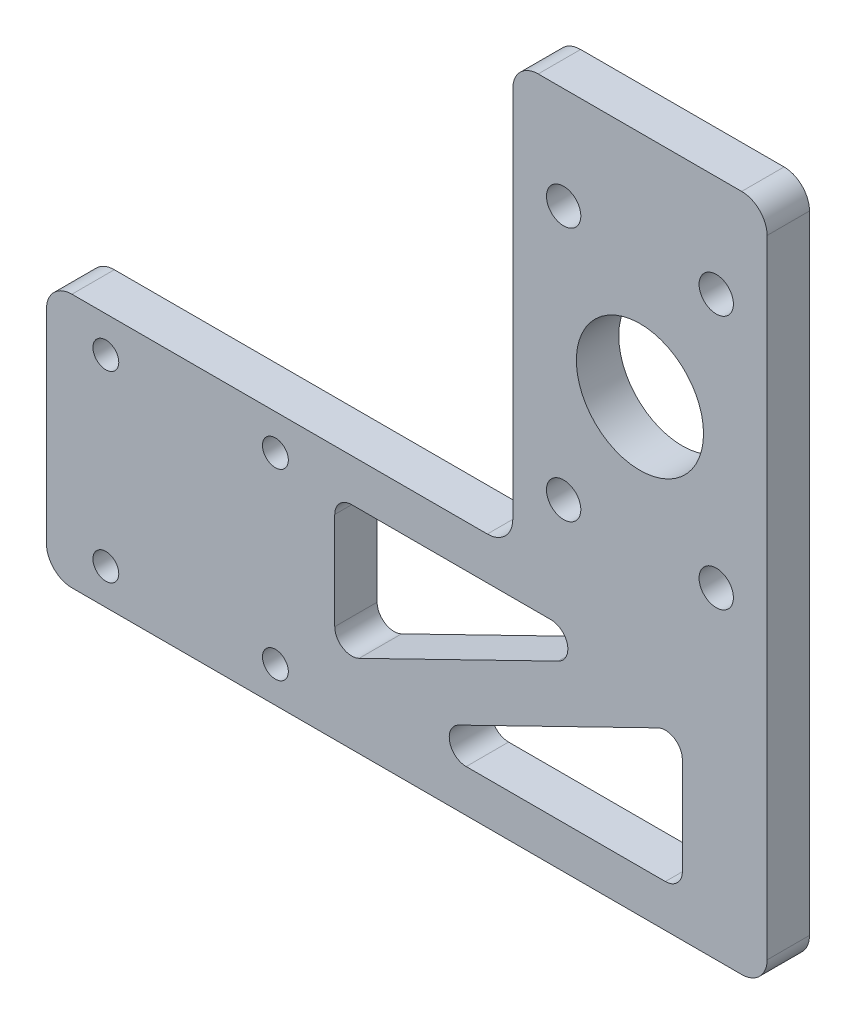
ISO-10303-21;
HEADER;
FILE_DESCRIPTION(('STEP AP214'),'2;1');
FILE_NAME('part.step','',(''),(''),'','','');
FILE_SCHEMA(('AUTOMOTIVE_DESIGN { 1 0 10303 214 1 1 1 1 }'));
ENDSEC;
DATA;
#1=APPLICATION_CONTEXT('core data for automotive mechanical design processes');
#2=APPLICATION_PROTOCOL_DEFINITION('international standard','automotive_design',2000,#1);
#3=PRODUCT_CONTEXT('',#1,'mechanical');
#4=PRODUCT('Part','Part','',(#3));
#5=PRODUCT_RELATED_PRODUCT_CATEGORY('part','',(#4));
#6=PRODUCT_DEFINITION_FORMATION('','',#4);
#7=PRODUCT_DEFINITION_CONTEXT('part definition',#1,'design');
#8=PRODUCT_DEFINITION('design','',#6,#7);
#9=PRODUCT_DEFINITION_SHAPE('','',#8);
#10=(LENGTH_UNIT() NAMED_UNIT(*) SI_UNIT(.MILLI.,.METRE.));
#11=(NAMED_UNIT(*) PLANE_ANGLE_UNIT() SI_UNIT($,.RADIAN.));
#12=(NAMED_UNIT(*) SI_UNIT($,.STERADIAN.) SOLID_ANGLE_UNIT());
#13=UNCERTAINTY_MEASURE_WITH_UNIT(LENGTH_MEASURE(1.E-05),#10,'distance_accuracy_value','');
#14=(GEOMETRIC_REPRESENTATION_CONTEXT(3) GLOBAL_UNCERTAINTY_ASSIGNED_CONTEXT((#13)) GLOBAL_UNIT_ASSIGNED_CONTEXT((#10,
#11,#12)) REPRESENTATION_CONTEXT('',''));
#15=CARTESIAN_POINT('',(0.,0.,0.));
#16=DIRECTION('',(0.,0.,1.));
#17=DIRECTION('',(1.,0.,0.));
#18=AXIS2_PLACEMENT_3D('',#15,#16,#17);
#19=CARTESIAN_POINT('',(0.,0.,5.));
#20=DIRECTION('',(0.,0.,-1.));
#21=DIRECTION('',(-1.,0.,0.));
#22=AXIS2_PLACEMENT_3D('',#19,#20,#21);
#23=PLANE('',#22);
#24=CARTESIAN_POINT('',(14.9999999996975,22.9999999999998,5.));
#25=DIRECTION('',(0.,0.,1.));
#26=DIRECTION('',(1.,0.,0.));
#27=AXIS2_PLACEMENT_3D('',#24,#25,#26);
#28=CIRCLE('',#27,7.5);
#29=CARTESIAN_POINT('',(22.4999999996975,22.9999999999998,5.));
#30=VERTEX_POINT('',#29);
#31=EDGE_CURVE('E544',#30,#30,#28,.T.);
#32=ORIENTED_EDGE('',*,*,#31,.F.);
#33=EDGE_LOOP('',(#32));
#34=FACE_BOUND('',#33,.T.);
#35=DIRECTION('',(0.,1.,0.));
#36=VECTOR('',#35,1.);
#37=CARTESIAN_POINT('',(30.,-30.,5.));
#38=LINE('',#37,#36);
#39=CARTESIAN_POINT('',(30.,-27.,5.));
#40=VERTEX_POINT('',#39);
#41=CARTESIAN_POINT('',(30.,47.,5.));
#42=VERTEX_POINT('',#41);
#43=EDGE_CURVE('E434',#40,#42,#38,.T.);
#44=ORIENTED_EDGE('',*,*,#43,.T.);
#45=CARTESIAN_POINT('',(27.,47.,5.));
#46=DIRECTION('',(0.,0.,-1.));
#47=DIRECTION('',(-1.,0.,0.));
#48=AXIS2_PLACEMENT_3D('',#45,#46,#47);
#49=CIRCLE('',#48,3.);
#50=CARTESIAN_POINT('',(27.,50.,5.));
#51=VERTEX_POINT('',#50);
#52=EDGE_CURVE('E269',#42,#51,#49,.F.);
#53=ORIENTED_EDGE('',*,*,#52,.T.);
#54=DIRECTION('',(-1.,0.,0.));
#55=VECTOR('',#54,1.);
#56=CARTESIAN_POINT('',(30.,50.,5.));
#57=LINE('',#56,#55);
#58=CARTESIAN_POINT('',(3.,50.,5.));
#59=VERTEX_POINT('',#58);
#60=EDGE_CURVE('E234',#51,#59,#57,.T.);
#61=ORIENTED_EDGE('',*,*,#60,.T.);
#62=CARTESIAN_POINT('',(3.,47.,5.));
#63=DIRECTION('',(0.,0.,-1.));
#64=DIRECTION('',(-1.,0.,0.));
#65=AXIS2_PLACEMENT_3D('',#62,#63,#64);
#66=CIRCLE('',#65,3.);
#67=CARTESIAN_POINT('',(0.,47.,5.));
#68=VERTEX_POINT('',#67);
#69=EDGE_CURVE('E261',#59,#68,#66,.F.);
#70=ORIENTED_EDGE('',*,*,#69,.T.);
#71=DIRECTION('',(0.,-1.,0.));
#72=VECTOR('',#71,1.);
#73=CARTESIAN_POINT('',(0.,50.,5.));
#74=LINE('',#73,#72);
#75=CARTESIAN_POINT('',(0.,3.,5.));
#76=VERTEX_POINT('',#75);
#77=EDGE_CURVE('E241',#68,#76,#74,.T.);
#78=ORIENTED_EDGE('',*,*,#77,.T.);
#79=CARTESIAN_POINT('',(-3.,3.,5.));
#80=DIRECTION('',(0.,0.,-1.));
#81=DIRECTION('',(-1.,0.,0.));
#82=AXIS2_PLACEMENT_3D('',#79,#80,#81);
#83=CIRCLE('',#82,3.);
#84=CARTESIAN_POINT('',(-3.,0.,5.));
#85=VERTEX_POINT('',#84);
#86=EDGE_CURVE('E293',#76,#85,#83,.T.);
#87=ORIENTED_EDGE('',*,*,#86,.T.);
#88=DIRECTION('',(-1.,0.,0.));
#89=VECTOR('',#88,1.);
#90=CARTESIAN_POINT('',(0.,0.,5.));
#91=LINE('',#90,#89);
#92=CARTESIAN_POINT('',(-52.,0.,5.));
#93=VERTEX_POINT('',#92);
#94=EDGE_CURVE('E245',#85,#93,#91,.T.);
#95=ORIENTED_EDGE('',*,*,#94,.T.);
#96=CARTESIAN_POINT('',(-52.,-3.00000000000001,5.));
#97=DIRECTION('',(0.,0.,-1.));
#98=DIRECTION('',(-1.,0.,0.));
#99=AXIS2_PLACEMENT_3D('',#96,#97,#98);
#100=CIRCLE('',#99,3.);
#101=CARTESIAN_POINT('',(-55.,-3.00000000000001,5.));
#102=VERTEX_POINT('',#101);
#103=EDGE_CURVE('E263',#93,#102,#100,.F.);
#104=ORIENTED_EDGE('',*,*,#103,.T.);
#105=DIRECTION('',(0.,-1.,0.));
#106=VECTOR('',#105,1.);
#107=CARTESIAN_POINT('',(-55.,0.,5.));
#108=LINE('',#107,#106);
#109=CARTESIAN_POINT('',(-55.,-27.,5.));
#110=VERTEX_POINT('',#109);
#111=EDGE_CURVE('E428',#102,#110,#108,.T.);
#112=ORIENTED_EDGE('',*,*,#111,.T.);
#113=CARTESIAN_POINT('',(-52.,-27.,5.));
#114=DIRECTION('',(0.,0.,-1.));
#115=DIRECTION('',(-1.,0.,0.));
#116=AXIS2_PLACEMENT_3D('',#113,#114,#115);
#117=CIRCLE('',#116,3.);
#118=CARTESIAN_POINT('',(-52.,-30.,5.));
#119=VERTEX_POINT('',#118);
#120=EDGE_CURVE('E265',#110,#119,#117,.F.);
#121=ORIENTED_EDGE('',*,*,#120,.T.);
#122=DIRECTION('',(1.,0.,0.));
#123=VECTOR('',#122,1.);
#124=CARTESIAN_POINT('',(-55.,-30.,5.));
#125=LINE('',#124,#123);
#126=CARTESIAN_POINT('',(27.,-30.,5.));
#127=VERTEX_POINT('',#126);
#128=EDGE_CURVE('E431',#119,#127,#125,.T.);
#129=ORIENTED_EDGE('',*,*,#128,.T.);
#130=CARTESIAN_POINT('',(27.,-27.,5.));
#131=DIRECTION('',(0.,0.,-1.));
#132=DIRECTION('',(-1.,0.,0.));
#133=AXIS2_PLACEMENT_3D('',#130,#131,#132);
#134=CIRCLE('',#133,3.);
#135=EDGE_CURVE('E267',#127,#40,#134,.F.);
#136=ORIENTED_EDGE('',*,*,#135,.T.);
#137=EDGE_LOOP('',(#44,#53,#61,#70,#78,#87,#95,#104,#112,#121,#129,#136));
#138=FACE_BOUND('',#137,.T.);
#139=CARTESIAN_POINT('',(23.9999999996975,37.9999999999998,5.));
#140=DIRECTION('',(0.,0.,-1.));
#141=DIRECTION('',(-1.,0.,0.));
#142=AXIS2_PLACEMENT_3D('',#139,#140,#141);
#143=CIRCLE('',#142,2.025);
#144=CARTESIAN_POINT('',(21.9749999996975,37.9999999999998,5.));
#145=VERTEX_POINT('',#144);
#146=EDGE_CURVE('E420',#145,#145,#143,.T.);
#147=ORIENTED_EDGE('',*,*,#146,.T.);
#148=EDGE_LOOP('',(#147));
#149=FACE_BOUND('',#148,.T.);
#150=CARTESIAN_POINT('',(5.99999999969746,7.99999999999981,5.));
#151=DIRECTION('',(0.,0.,-1.));
#152=DIRECTION('',(-1.,0.,0.));
#153=AXIS2_PLACEMENT_3D('',#150,#151,#152);
#154=CIRCLE('',#153,2.025);
#155=CARTESIAN_POINT('',(3.97499999969746,7.99999999999981,5.));
#156=VERTEX_POINT('',#155);
#157=EDGE_CURVE('E402',#156,#156,#154,.T.);
#158=ORIENTED_EDGE('',*,*,#157,.T.);
#159=EDGE_LOOP('',(#158));
#160=FACE_BOUND('',#159,.T.);
#161=CARTESIAN_POINT('',(23.9999999996975,7.99999999999981,5.));
#162=DIRECTION('',(0.,0.,-1.));
#163=DIRECTION('',(-1.,0.,0.));
#164=AXIS2_PLACEMENT_3D('',#161,#162,#163);
#165=CIRCLE('',#164,2.025);
#166=CARTESIAN_POINT('',(21.9749999996975,7.99999999999981,5.));
#167=VERTEX_POINT('',#166);
#168=EDGE_CURVE('E415',#167,#167,#165,.T.);
#169=ORIENTED_EDGE('',*,*,#168,.T.);
#170=EDGE_LOOP('',(#169));
#171=FACE_BOUND('',#170,.T.);
#172=CARTESIAN_POINT('',(5.99999999969747,37.9999999999998,5.));
#173=DIRECTION('',(0.,0.,-1.));
#174=DIRECTION('',(-1.,0.,0.));
#175=AXIS2_PLACEMENT_3D('',#172,#173,#174);
#176=CIRCLE('',#175,2.025);
#177=CARTESIAN_POINT('',(3.97499999969747,37.9999999999998,5.));
#178=VERTEX_POINT('',#177);
#179=EDGE_CURVE('E408',#178,#178,#176,.T.);
#180=ORIENTED_EDGE('',*,*,#179,.T.);
#181=EDGE_LOOP('',(#180));
#182=FACE_BOUND('',#181,.T.);
#183=CARTESIAN_POINT('',(-48.,-25.8,5.));
#184=DIRECTION('',(0.,0.,1.));
#185=DIRECTION('',(1.,0.,0.));
#186=AXIS2_PLACEMENT_3D('',#183,#184,#185);
#187=CIRCLE('',#186,1.525);
#188=CARTESIAN_POINT('',(-46.475,-25.8,5.));
#189=VERTEX_POINT('',#188);
#190=EDGE_CURVE('E381',#189,#189,#187,.T.);
#191=ORIENTED_EDGE('',*,*,#190,.F.);
#192=EDGE_LOOP('',(#191));
#193=FACE_BOUND('',#192,.T.);
#194=CARTESIAN_POINT('',(-48.,-4.2,5.));
#195=DIRECTION('',(0.,0.,1.));
#196=DIRECTION('',(1.,0.,0.));
#197=AXIS2_PLACEMENT_3D('',#194,#195,#196);
#198=CIRCLE('',#197,1.525);
#199=CARTESIAN_POINT('',(-46.475,-4.2,5.));
#200=VERTEX_POINT('',#199);
#201=EDGE_CURVE('E382',#200,#200,#198,.T.);
#202=ORIENTED_EDGE('',*,*,#201,.F.);
#203=EDGE_LOOP('',(#202));
#204=FACE_BOUND('',#203,.T.);
#205=CARTESIAN_POINT('',(-28.,-4.2,5.));
#206=DIRECTION('',(0.,0.,1.));
#207=DIRECTION('',(1.,0.,0.));
#208=AXIS2_PLACEMENT_3D('',#205,#206,#207);
#209=CIRCLE('',#208,1.525);
#210=CARTESIAN_POINT('',(-26.475,-4.2,5.));
#211=VERTEX_POINT('',#210);
#212=EDGE_CURVE('E388',#211,#211,#209,.T.);
#213=ORIENTED_EDGE('',*,*,#212,.F.);
#214=EDGE_LOOP('',(#213));
#215=FACE_BOUND('',#214,.T.);
#216=CARTESIAN_POINT('',(-28.,-25.8,5.));
#217=DIRECTION('',(0.,0.,1.));
#218=DIRECTION('',(1.,0.,0.));
#219=AXIS2_PLACEMENT_3D('',#216,#217,#218);
#220=CIRCLE('',#219,1.525);
#221=CARTESIAN_POINT('',(-26.475,-25.8,5.));
#222=VERTEX_POINT('',#221);
#223=EDGE_CURVE('E373',#222,#222,#220,.T.);
#224=ORIENTED_EDGE('',*,*,#223,.F.);
#225=EDGE_LOOP('',(#224));
#226=FACE_BOUND('',#225,.T.);
#227=DIRECTION('',(0.8987684456439,0.438423632021415,0.));
#228=VECTOR('',#227,1.);
#229=CARTESIAN_POINT('',(4.49924135765993,-9.22344478320285,5.));
#230=LINE('',#229,#228);
#231=CARTESIAN_POINT('',(-18.1231527359572,-20.2587589752112,5.));
#232=VERTEX_POINT('',#231);
#233=CARTESIAN_POINT('',(5.37235253608578,-8.7975368912878,5.));
#234=VERTEX_POINT('',#233);
#235=EDGE_CURVE('E359',#232,#234,#230,.T.);
#236=ORIENTED_EDGE('',*,*,#235,.F.);
#237=CARTESIAN_POINT('',(-19.,-18.4612220839234,5.));
#238=DIRECTION('',(0.,0.,-1.));
#239=DIRECTION('',(-1.,0.,0.));
#240=AXIS2_PLACEMENT_3D('',#237,#238,#239);
#241=CIRCLE('',#240,2.);
#242=CARTESIAN_POINT('',(-21.,-18.4612220839234,5.));
#243=VERTEX_POINT('',#242);
#244=EDGE_CURVE('E340',#232,#243,#241,.T.);
#245=ORIENTED_EDGE('',*,*,#244,.T.);
#246=DIRECTION('',(0.,-1.,0.));
#247=VECTOR('',#246,1.);
#248=CARTESIAN_POINT('',(-21.,0.,5.));
#249=LINE('',#248,#247);
#250=CARTESIAN_POINT('',(-21.,-7.,5.));
#251=VERTEX_POINT('',#250);
#252=EDGE_CURVE('E350',#251,#243,#249,.T.);
#253=ORIENTED_EDGE('',*,*,#252,.F.);
#254=CARTESIAN_POINT('',(-19.,-7.,5.));
#255=DIRECTION('',(0.,0.,-1.));
#256=DIRECTION('',(-1.,0.,0.));
#257=AXIS2_PLACEMENT_3D('',#254,#255,#256);
#258=CIRCLE('',#257,2.);
#259=CARTESIAN_POINT('',(-19.,-5.,5.));
#260=VERTEX_POINT('',#259);
#261=EDGE_CURVE('E61',#251,#260,#258,.T.);
#262=ORIENTED_EDGE('',*,*,#261,.T.);
#263=DIRECTION('',(1.,0.,0.));
#264=VECTOR('',#263,1.);
#265=CARTESIAN_POINT('',(0.,-5.,5.));
#266=LINE('',#265,#264);
#267=CARTESIAN_POINT('',(4.49550527204295,-5.,5.));
#268=VERTEX_POINT('',#267);
#269=EDGE_CURVE('E349',#260,#268,#266,.T.);
#270=ORIENTED_EDGE('',*,*,#269,.T.);
#271=CARTESIAN_POINT('',(4.49550527204295,-7.,5.));
#272=DIRECTION('',(0.,0.,-1.));
#273=DIRECTION('',(-1.,0.,0.));
#274=AXIS2_PLACEMENT_3D('',#271,#272,#273);
#275=CIRCLE('',#274,2.);
#276=EDGE_CURVE('E336',#268,#234,#275,.T.);
#277=ORIENTED_EDGE('',*,*,#276,.T.);
#278=EDGE_LOOP('',(#236,#245,#253,#262,#270,#277));
#279=FACE_BOUND('',#278,.T.);
#280=DIRECTION('',(1.,0.,0.));
#281=VECTOR('',#280,1.);
#282=CARTESIAN_POINT('',(0.,-25.,5.));
#283=LINE('',#282,#281);
#284=CARTESIAN_POINT('',(-5.49550527204297,-25.,5.));
#285=VERTEX_POINT('',#284);
#286=CARTESIAN_POINT('',(18.,-25.,5.));
#287=VERTEX_POINT('',#286);
#288=EDGE_CURVE('E551',#285,#287,#283,.T.);
#289=ORIENTED_EDGE('',*,*,#288,.F.);
#290=CARTESIAN_POINT('',(-5.49550527204297,-23.,5.));
#291=DIRECTION('',(0.,0.,-1.));
#292=DIRECTION('',(-1.,0.,0.));
#293=AXIS2_PLACEMENT_3D('',#290,#291,#292);
#294=CIRCLE('',#293,2.);
#295=CARTESIAN_POINT('',(-6.37235253608581,-21.2024631087122,5.));
#296=VERTEX_POINT('',#295);
#297=EDGE_CURVE('E328',#285,#296,#294,.T.);
#298=ORIENTED_EDGE('',*,*,#297,.T.);
#299=DIRECTION('',(0.8987684456439,0.438423632021415,0.));
#300=VECTOR('',#299,1.);
#301=CARTESIAN_POINT('',(7.12978314978842,-14.6160554570662,5.));
#302=LINE('',#301,#300);
#303=CARTESIAN_POINT('',(17.1231527359572,-9.7412410247888,5.));
#304=VERTEX_POINT('',#303);
#305=EDGE_CURVE('E548',#296,#304,#302,.T.);
#306=ORIENTED_EDGE('',*,*,#305,.T.);
#307=CARTESIAN_POINT('',(18.,-11.5387779160766,5.));
#308=DIRECTION('',(0.,0.,-1.));
#309=DIRECTION('',(-1.,0.,0.));
#310=AXIS2_PLACEMENT_3D('',#307,#308,#309);
#311=CIRCLE('',#310,2.);
#312=CARTESIAN_POINT('',(20.,-11.5387779160766,5.));
#313=VERTEX_POINT('',#312);
#314=EDGE_CURVE('E332',#304,#313,#311,.T.);
#315=ORIENTED_EDGE('',*,*,#314,.T.);
#316=DIRECTION('',(0.,-1.,0.));
#317=VECTOR('',#316,1.);
#318=CARTESIAN_POINT('',(20.,0.,5.));
#319=LINE('',#318,#317);
#320=CARTESIAN_POINT('',(20.,-23.,5.));
#321=VERTEX_POINT('',#320);
#322=EDGE_CURVE('E369',#313,#321,#319,.T.);
#323=ORIENTED_EDGE('',*,*,#322,.T.);
#324=CARTESIAN_POINT('',(18.,-23.,5.));
#325=DIRECTION('',(0.,0.,-1.));
#326=DIRECTION('',(-1.,0.,0.));
#327=AXIS2_PLACEMENT_3D('',#324,#325,#326);
#328=CIRCLE('',#327,2.);
#329=EDGE_CURVE('E324',#321,#287,#328,.T.);
#330=ORIENTED_EDGE('',*,*,#329,.T.);
#331=EDGE_LOOP('',(#289,#298,#306,#315,#323,#330));
#332=FACE_BOUND('',#331,.T.);
#333=ADVANCED_FACE('F53',(#34,#138,#149,#160,#171,#182,#193,#204,#215,#226,#279,#332),#23,.F.);
#334=CARTESIAN_POINT('',(0.,0.,0.));
#335=DIRECTION('',(0.,0.,-1.));
#336=DIRECTION('',(-1.,0.,0.));
#337=AXIS2_PLACEMENT_3D('',#334,#335,#336);
#338=PLANE('',#337);
#339=CARTESIAN_POINT('',(14.9999999996975,22.9999999999998,0.));
#340=DIRECTION('',(0.,0.,-1.));
#341=DIRECTION('',(-1.,0.,0.));
#342=AXIS2_PLACEMENT_3D('',#339,#340,#341);
#343=CIRCLE('',#342,7.5);
#344=CARTESIAN_POINT('',(7.49999999969747,22.9999999999998,0.));
#345=VERTEX_POINT('',#344);
#346=EDGE_CURVE('E547',#345,#345,#343,.F.);
#347=ORIENTED_EDGE('',*,*,#346,.T.);
#348=EDGE_LOOP('',(#347));
#349=FACE_BOUND('',#348,.T.);
#350=DIRECTION('',(1.,0.,0.));
#351=VECTOR('',#350,1.);
#352=CARTESIAN_POINT('',(0.,-5.,0.));
#353=LINE('',#352,#351);
#354=CARTESIAN_POINT('',(-19.,-5.,0.));
#355=VERTEX_POINT('',#354);
#356=CARTESIAN_POINT('',(4.49550527204295,-5.,0.));
#357=VERTEX_POINT('',#356);
#358=EDGE_CURVE('E366',#355,#357,#353,.T.);
#359=ORIENTED_EDGE('',*,*,#358,.F.);
#360=CARTESIAN_POINT('',(-19.,-7.,0.));
#361=DIRECTION('',(0.,0.,-1.));
#362=DIRECTION('',(-1.,0.,0.));
#363=AXIS2_PLACEMENT_3D('',#360,#361,#362);
#364=CIRCLE('',#363,2.);
#365=CARTESIAN_POINT('',(-21.,-7.,0.));
#366=VERTEX_POINT('',#365);
#367=EDGE_CURVE('E12',#355,#366,#364,.F.);
#368=ORIENTED_EDGE('',*,*,#367,.T.);
#369=DIRECTION('',(0.,-1.,0.));
#370=VECTOR('',#369,1.);
#371=CARTESIAN_POINT('',(-21.,0.,0.));
#372=LINE('',#371,#370);
#373=CARTESIAN_POINT('',(-21.,-18.4612220839234,0.));
#374=VERTEX_POINT('',#373);
#375=EDGE_CURVE('E358',#366,#374,#372,.T.);
#376=ORIENTED_EDGE('',*,*,#375,.T.);
#377=CARTESIAN_POINT('',(-19.,-18.4612220839234,0.));
#378=DIRECTION('',(0.,0.,-1.));
#379=DIRECTION('',(-1.,0.,0.));
#380=AXIS2_PLACEMENT_3D('',#377,#378,#379);
#381=CIRCLE('',#380,2.);
#382=CARTESIAN_POINT('',(-18.1231527359572,-20.2587589752112,0.));
#383=VERTEX_POINT('',#382);
#384=EDGE_CURVE('E342',#374,#383,#381,.F.);
#385=ORIENTED_EDGE('',*,*,#384,.T.);
#386=DIRECTION('',(0.8987684456439,0.438423632021415,0.));
#387=VECTOR('',#386,1.);
#388=CARTESIAN_POINT('',(4.49924135765993,-9.22344478320285,0.));
#389=LINE('',#388,#387);
#390=CARTESIAN_POINT('',(5.37235253608578,-8.7975368912878,0.));
#391=VERTEX_POINT('',#390);
#392=EDGE_CURVE('E363',#383,#391,#389,.T.);
#393=ORIENTED_EDGE('',*,*,#392,.T.);
#394=CARTESIAN_POINT('',(4.49550527204295,-7.,0.));
#395=DIRECTION('',(0.,0.,-1.));
#396=DIRECTION('',(-1.,0.,0.));
#397=AXIS2_PLACEMENT_3D('',#394,#395,#396);
#398=CIRCLE('',#397,2.);
#399=EDGE_CURVE('E338',#391,#357,#398,.F.);
#400=ORIENTED_EDGE('',*,*,#399,.T.);
#401=EDGE_LOOP('',(#359,#368,#376,#385,#393,#400));
#402=FACE_BOUND('',#401,.T.);
#403=CARTESIAN_POINT('',(-28.,-25.8,0.));
#404=DIRECTION('',(0.,0.,1.));
#405=DIRECTION('',(1.,0.,0.));
#406=AXIS2_PLACEMENT_3D('',#403,#404,#405);
#407=CIRCLE('',#406,1.525);
#408=CARTESIAN_POINT('',(-26.475,-25.8,0.));
#409=VERTEX_POINT('',#408);
#410=EDGE_CURVE('E391',#409,#409,#407,.T.);
#411=ORIENTED_EDGE('',*,*,#410,.T.);
#412=EDGE_LOOP('',(#411));
#413=FACE_BOUND('',#412,.T.);
#414=CARTESIAN_POINT('',(-28.,-4.2,0.));
#415=DIRECTION('',(0.,0.,1.));
#416=DIRECTION('',(1.,0.,0.));
#417=AXIS2_PLACEMENT_3D('',#414,#415,#416);
#418=CIRCLE('',#417,1.525);
#419=CARTESIAN_POINT('',(-26.475,-4.2,0.));
#420=VERTEX_POINT('',#419);
#421=EDGE_CURVE('E385',#420,#420,#418,.T.);
#422=ORIENTED_EDGE('',*,*,#421,.T.);
#423=EDGE_LOOP('',(#422));
#424=FACE_BOUND('',#423,.T.);
#425=CARTESIAN_POINT('',(-48.,-4.2,0.));
#426=DIRECTION('',(0.,0.,1.));
#427=DIRECTION('',(1.,0.,0.));
#428=AXIS2_PLACEMENT_3D('',#425,#426,#427);
#429=CIRCLE('',#428,1.525);
#430=CARTESIAN_POINT('',(-46.475,-4.2,0.));
#431=VERTEX_POINT('',#430);
#432=EDGE_CURVE('E378',#431,#431,#429,.T.);
#433=ORIENTED_EDGE('',*,*,#432,.T.);
#434=EDGE_LOOP('',(#433));
#435=FACE_BOUND('',#434,.T.);
#436=CARTESIAN_POINT('',(-48.,-25.8,0.));
#437=DIRECTION('',(0.,0.,1.));
#438=DIRECTION('',(1.,0.,0.));
#439=AXIS2_PLACEMENT_3D('',#436,#437,#438);
#440=CIRCLE('',#439,1.525);
#441=CARTESIAN_POINT('',(-46.475,-25.8,0.));
#442=VERTEX_POINT('',#441);
#443=EDGE_CURVE('E396',#442,#442,#440,.T.);
#444=ORIENTED_EDGE('',*,*,#443,.T.);
#445=EDGE_LOOP('',(#444));
#446=FACE_BOUND('',#445,.T.);
#447=CARTESIAN_POINT('',(5.99999999969747,37.9999999999998,0.));
#448=DIRECTION('',(0.,0.,-1.));
#449=DIRECTION('',(-1.,0.,0.));
#450=AXIS2_PLACEMENT_3D('',#447,#448,#449);
#451=CIRCLE('',#450,2.025);
#452=CARTESIAN_POINT('',(3.97499999969747,37.9999999999998,0.));
#453=VERTEX_POINT('',#452);
#454=EDGE_CURVE('E412',#453,#453,#451,.T.);
#455=ORIENTED_EDGE('',*,*,#454,.F.);
#456=EDGE_LOOP('',(#455));
#457=FACE_BOUND('',#456,.T.);
#458=CARTESIAN_POINT('',(23.9999999996975,7.99999999999981,0.));
#459=DIRECTION('',(0.,0.,-1.));
#460=DIRECTION('',(-1.,0.,0.));
#461=AXIS2_PLACEMENT_3D('',#458,#459,#460);
#462=CIRCLE('',#461,2.025);
#463=CARTESIAN_POINT('',(21.9749999996975,7.99999999999981,0.));
#464=VERTEX_POINT('',#463);
#465=EDGE_CURVE('E405',#464,#464,#462,.T.);
#466=ORIENTED_EDGE('',*,*,#465,.F.);
#467=EDGE_LOOP('',(#466));
#468=FACE_BOUND('',#467,.T.);
#469=CARTESIAN_POINT('',(5.99999999969746,7.99999999999981,0.));
#470=DIRECTION('',(0.,0.,-1.));
#471=DIRECTION('',(-1.,0.,0.));
#472=AXIS2_PLACEMENT_3D('',#469,#470,#471);
#473=CIRCLE('',#472,2.025);
#474=CARTESIAN_POINT('',(3.97499999969746,7.99999999999981,0.));
#475=VERTEX_POINT('',#474);
#476=EDGE_CURVE('E399',#475,#475,#473,.T.);
#477=ORIENTED_EDGE('',*,*,#476,.F.);
#478=EDGE_LOOP('',(#477));
#479=FACE_BOUND('',#478,.T.);
#480=CARTESIAN_POINT('',(23.9999999996975,37.9999999999998,0.));
#481=DIRECTION('',(0.,0.,-1.));
#482=DIRECTION('',(-1.,0.,0.));
#483=AXIS2_PLACEMENT_3D('',#480,#481,#482);
#484=CIRCLE('',#483,2.025);
#485=CARTESIAN_POINT('',(21.9749999996975,37.9999999999998,0.));
#486=VERTEX_POINT('',#485);
#487=EDGE_CURVE('E411',#486,#486,#484,.T.);
#488=ORIENTED_EDGE('',*,*,#487,.F.);
#489=EDGE_LOOP('',(#488));
#490=FACE_BOUND('',#489,.T.);
#491=DIRECTION('',(-1.,0.,0.));
#492=VECTOR('',#491,1.);
#493=CARTESIAN_POINT('',(30.,50.,0.));
#494=LINE('',#493,#492);
#495=CARTESIAN_POINT('',(27.,50.,0.));
#496=VERTEX_POINT('',#495);
#497=CARTESIAN_POINT('',(3.,50.,0.));
#498=VERTEX_POINT('',#497);
#499=EDGE_CURVE('E231',#496,#498,#494,.T.);
#500=ORIENTED_EDGE('',*,*,#499,.F.);
#501=CARTESIAN_POINT('',(27.,47.,0.));
#502=DIRECTION('',(0.,0.,-1.));
#503=DIRECTION('',(-1.,0.,0.));
#504=AXIS2_PLACEMENT_3D('',#501,#502,#503);
#505=CIRCLE('',#504,3.);
#506=CARTESIAN_POINT('',(30.,47.,0.));
#507=VERTEX_POINT('',#506);
#508=EDGE_CURVE('E214',#496,#507,#505,.T.);
#509=ORIENTED_EDGE('',*,*,#508,.T.);
#510=DIRECTION('',(0.,1.,0.));
#511=VECTOR('',#510,1.);
#512=CARTESIAN_POINT('',(30.,-30.,0.));
#513=LINE('',#512,#511);
#514=CARTESIAN_POINT('',(30.,-27.,0.));
#515=VERTEX_POINT('',#514);
#516=EDGE_CURVE('E242',#515,#507,#513,.T.);
#517=ORIENTED_EDGE('',*,*,#516,.F.);
#518=CARTESIAN_POINT('',(27.,-27.,0.));
#519=DIRECTION('',(0.,0.,-1.));
#520=DIRECTION('',(-1.,0.,0.));
#521=AXIS2_PLACEMENT_3D('',#518,#519,#520);
#522=CIRCLE('',#521,3.);
#523=CARTESIAN_POINT('',(27.,-30.,0.));
#524=VERTEX_POINT('',#523);
#525=EDGE_CURVE('E225',#515,#524,#522,.T.);
#526=ORIENTED_EDGE('',*,*,#525,.T.);
#527=DIRECTION('',(1.,0.,0.));
#528=VECTOR('',#527,1.);
#529=CARTESIAN_POINT('',(-55.,-30.,0.));
#530=LINE('',#529,#528);
#531=CARTESIAN_POINT('',(-52.,-30.,0.));
#532=VERTEX_POINT('',#531);
#533=EDGE_CURVE('E247',#532,#524,#530,.T.);
#534=ORIENTED_EDGE('',*,*,#533,.F.);
#535=CARTESIAN_POINT('',(-52.,-27.,0.));
#536=DIRECTION('',(0.,0.,-1.));
#537=DIRECTION('',(-1.,0.,0.));
#538=AXIS2_PLACEMENT_3D('',#535,#536,#537);
#539=CIRCLE('',#538,3.);
#540=CARTESIAN_POINT('',(-55.,-27.,0.));
#541=VERTEX_POINT('',#540);
#542=EDGE_CURVE('E255',#532,#541,#539,.T.);
#543=ORIENTED_EDGE('',*,*,#542,.T.);
#544=DIRECTION('',(0.,-1.,0.));
#545=VECTOR('',#544,1.);
#546=CARTESIAN_POINT('',(-55.,0.,0.));
#547=LINE('',#546,#545);
#548=CARTESIAN_POINT('',(-55.,-3.00000000000001,0.));
#549=VERTEX_POINT('',#548);
#550=EDGE_CURVE('E443',#549,#541,#547,.T.);
#551=ORIENTED_EDGE('',*,*,#550,.F.);
#552=CARTESIAN_POINT('',(-52.,-3.00000000000001,0.));
#553=DIRECTION('',(0.,0.,-1.));
#554=DIRECTION('',(-1.,0.,0.));
#555=AXIS2_PLACEMENT_3D('',#552,#553,#554);
#556=CIRCLE('',#555,3.);
#557=CARTESIAN_POINT('',(-52.,0.,0.));
#558=VERTEX_POINT('',#557);
#559=EDGE_CURVE('E253',#549,#558,#556,.T.);
#560=ORIENTED_EDGE('',*,*,#559,.T.);
#561=DIRECTION('',(-1.,0.,0.));
#562=VECTOR('',#561,1.);
#563=CARTESIAN_POINT('',(0.,0.,0.));
#564=LINE('',#563,#562);
#565=CARTESIAN_POINT('',(-3.,0.,0.));
#566=VERTEX_POINT('',#565);
#567=EDGE_CURVE('E440',#566,#558,#564,.T.);
#568=ORIENTED_EDGE('',*,*,#567,.F.);
#569=CARTESIAN_POINT('',(-3.,3.,0.));
#570=DIRECTION('',(0.,0.,-1.));
#571=DIRECTION('',(-1.,0.,0.));
#572=AXIS2_PLACEMENT_3D('',#569,#570,#571);
#573=CIRCLE('',#572,3.);
#574=CARTESIAN_POINT('',(0.,3.,0.));
#575=VERTEX_POINT('',#574);
#576=EDGE_CURVE('E291',#566,#575,#573,.F.);
#577=ORIENTED_EDGE('',*,*,#576,.T.);
#578=DIRECTION('',(0.,-1.,0.));
#579=VECTOR('',#578,1.);
#580=CARTESIAN_POINT('',(0.,50.,0.));
#581=LINE('',#580,#579);
#582=CARTESIAN_POINT('',(0.,47.,0.));
#583=VERTEX_POINT('',#582);
#584=EDGE_CURVE('E423',#583,#575,#581,.T.);
#585=ORIENTED_EDGE('',*,*,#584,.F.);
#586=CARTESIAN_POINT('',(3.,47.,0.));
#587=DIRECTION('',(0.,0.,-1.));
#588=DIRECTION('',(-1.,0.,0.));
#589=AXIS2_PLACEMENT_3D('',#586,#587,#588);
#590=CIRCLE('',#589,3.);
#591=EDGE_CURVE('E235',#583,#498,#590,.T.);
#592=ORIENTED_EDGE('',*,*,#591,.T.);
#593=EDGE_LOOP('',(#500,#509,#517,#526,#534,#543,#551,#560,#568,#577,#585,#592));
#594=FACE_BOUND('',#593,.T.);
#595=DIRECTION('',(0.,-1.,0.));
#596=VECTOR('',#595,1.);
#597=CARTESIAN_POINT('',(20.,0.,0.));
#598=LINE('',#597,#596);
#599=CARTESIAN_POINT('',(20.,-11.5387779160766,0.));
#600=VERTEX_POINT('',#599);
#601=CARTESIAN_POINT('',(20.,-23.,0.));
#602=VERTEX_POINT('',#601);
#603=EDGE_CURVE('E375',#600,#602,#598,.T.);
#604=ORIENTED_EDGE('',*,*,#603,.F.);
#605=CARTESIAN_POINT('',(18.,-11.5387779160766,0.));
#606=DIRECTION('',(0.,0.,-1.));
#607=DIRECTION('',(-1.,0.,0.));
#608=AXIS2_PLACEMENT_3D('',#605,#606,#607);
#609=CIRCLE('',#608,2.);
#610=CARTESIAN_POINT('',(17.1231527359572,-9.7412410247888,0.));
#611=VERTEX_POINT('',#610);
#612=EDGE_CURVE('E334',#600,#611,#609,.F.);
#613=ORIENTED_EDGE('',*,*,#612,.T.);
#614=DIRECTION('',(0.8987684456439,0.438423632021415,0.));
#615=VECTOR('',#614,1.);
#616=CARTESIAN_POINT('',(7.12978314978842,-14.6160554570662,0.));
#617=LINE('',#616,#615);
#618=CARTESIAN_POINT('',(-6.37235253608581,-21.2024631087122,0.));
#619=VERTEX_POINT('',#618);
#620=EDGE_CURVE('E555',#619,#611,#617,.T.);
#621=ORIENTED_EDGE('',*,*,#620,.F.);
#622=CARTESIAN_POINT('',(-5.49550527204297,-23.,0.));
#623=DIRECTION('',(0.,0.,-1.));
#624=DIRECTION('',(-1.,0.,0.));
#625=AXIS2_PLACEMENT_3D('',#622,#623,#624);
#626=CIRCLE('',#625,2.);
#627=CARTESIAN_POINT('',(-5.49550527204297,-25.,0.));
#628=VERTEX_POINT('',#627);
#629=EDGE_CURVE('E330',#619,#628,#626,.F.);
#630=ORIENTED_EDGE('',*,*,#629,.T.);
#631=DIRECTION('',(1.,0.,0.));
#632=VECTOR('',#631,1.);
#633=CARTESIAN_POINT('',(0.,-25.,0.));
#634=LINE('',#633,#632);
#635=CARTESIAN_POINT('',(18.,-25.,0.));
#636=VERTEX_POINT('',#635);
#637=EDGE_CURVE('E558',#628,#636,#634,.T.);
#638=ORIENTED_EDGE('',*,*,#637,.T.);
#639=CARTESIAN_POINT('',(18.,-23.,0.));
#640=DIRECTION('',(0.,0.,-1.));
#641=DIRECTION('',(-1.,0.,0.));
#642=AXIS2_PLACEMENT_3D('',#639,#640,#641);
#643=CIRCLE('',#642,2.);
#644=EDGE_CURVE('E326',#636,#602,#643,.F.);
#645=ORIENTED_EDGE('',*,*,#644,.T.);
#646=EDGE_LOOP('',(#604,#613,#621,#630,#638,#645));
#647=FACE_BOUND('',#646,.T.);
#648=ADVANCED_FACE('F238',(#349,#402,#413,#424,#435,#446,#457,#468,#479,#490,#594,#647),#338,.T.);
#649=CARTESIAN_POINT('',(0.,50.,5.));
#650=DIRECTION('',(1.,0.,0.));
#651=DIRECTION('',(0.,1.,0.));
#652=AXIS2_PLACEMENT_3D('',#649,#650,#651);
#653=PLANE('',#652);
#654=ORIENTED_EDGE('',*,*,#584,.T.);
#655=DIRECTION('',(0.,0.,-1.));
#656=VECTOR('',#655,1.);
#657=CARTESIAN_POINT('',(0.,3.,5.));
#658=LINE('',#657,#656);
#659=EDGE_CURVE('E289',#575,#76,#658,.F.);
#660=ORIENTED_EDGE('',*,*,#659,.T.);
#661=ORIENTED_EDGE('',*,*,#77,.F.);
#662=DIRECTION('',(0.,0.,-1.));
#663=VECTOR('',#662,1.);
#664=CARTESIAN_POINT('',(0.,47.,5.));
#665=LINE('',#664,#663);
#666=EDGE_CURVE('E286',#68,#583,#665,.T.);
#667=ORIENTED_EDGE('',*,*,#666,.T.);
#668=EDGE_LOOP('',(#654,#660,#661,#667));
#669=FACE_BOUND('',#668,.T.);
#670=ADVANCED_FACE('F477',(#669),#653,.F.);
#671=CARTESIAN_POINT('',(0.,0.,5.));
#672=DIRECTION('',(0.,-1.,0.));
#673=DIRECTION('',(1.,0.,0.));
#674=AXIS2_PLACEMENT_3D('',#671,#672,#673);
#675=PLANE('',#674);
#676=ORIENTED_EDGE('',*,*,#567,.T.);
#677=DIRECTION('',(0.,0.,-1.));
#678=VECTOR('',#677,1.);
#679=CARTESIAN_POINT('',(-52.,0.,5.));
#680=LINE('',#679,#678);
#681=EDGE_CURVE('E284',#558,#93,#680,.F.);
#682=ORIENTED_EDGE('',*,*,#681,.T.);
#683=ORIENTED_EDGE('',*,*,#94,.F.);
#684=DIRECTION('',(0.,0.,-1.));
#685=VECTOR('',#684,1.);
#686=CARTESIAN_POINT('',(-3.,0.,0.));
#687=LINE('',#686,#685);
#688=EDGE_CURVE('E281',#85,#566,#687,.T.);
#689=ORIENTED_EDGE('',*,*,#688,.T.);
#690=EDGE_LOOP('',(#676,#682,#683,#689));
#691=FACE_BOUND('',#690,.T.);
#692=ADVANCED_FACE('F668',(#691),#675,.F.);
#693=CARTESIAN_POINT('',(-55.,0.,5.));
#694=DIRECTION('',(1.,0.,0.));
#695=DIRECTION('',(0.,0.,-1.));
#696=AXIS2_PLACEMENT_3D('',#693,#694,#695);
#697=PLANE('',#696);
#698=ORIENTED_EDGE('',*,*,#550,.T.);
#699=DIRECTION('',(0.,0.,-1.));
#700=VECTOR('',#699,1.);
#701=CARTESIAN_POINT('',(-55.,-27.,5.));
#702=LINE('',#701,#700);
#703=EDGE_CURVE('E279',#541,#110,#702,.F.);
#704=ORIENTED_EDGE('',*,*,#703,.T.);
#705=ORIENTED_EDGE('',*,*,#111,.F.);
#706=DIRECTION('',(0.,0.,-1.));
#707=VECTOR('',#706,1.);
#708=CARTESIAN_POINT('',(-55.,-3.00000000000001,5.));
#709=LINE('',#708,#707);
#710=EDGE_CURVE('E276',#102,#549,#709,.T.);
#711=ORIENTED_EDGE('',*,*,#710,.T.);
#712=EDGE_LOOP('',(#698,#704,#705,#711));
#713=FACE_BOUND('',#712,.T.);
#714=ADVANCED_FACE('F469',(#713),#697,.F.);
#715=CARTESIAN_POINT('',(-55.,-30.,5.));
#716=DIRECTION('',(0.,1.,0.));
#717=DIRECTION('',(0.,0.,1.));
#718=AXIS2_PLACEMENT_3D('',#715,#716,#717);
#719=PLANE('',#718);
#720=ORIENTED_EDGE('',*,*,#533,.T.);
#721=DIRECTION('',(0.,0.,-1.));
#722=VECTOR('',#721,1.);
#723=CARTESIAN_POINT('',(27.,-30.,5.));
#724=LINE('',#723,#722);
#725=EDGE_CURVE('E274',#524,#127,#724,.F.);
#726=ORIENTED_EDGE('',*,*,#725,.T.);
#727=ORIENTED_EDGE('',*,*,#128,.F.);
#728=DIRECTION('',(0.,0.,-1.));
#729=VECTOR('',#728,1.);
#730=CARTESIAN_POINT('',(-52.,-30.,5.));
#731=LINE('',#730,#729);
#732=EDGE_CURVE('E271',#119,#532,#731,.T.);
#733=ORIENTED_EDGE('',*,*,#732,.T.);
#734=EDGE_LOOP('',(#720,#726,#727,#733));
#735=FACE_BOUND('',#734,.T.);
#736=ADVANCED_FACE('F449',(#735),#719,.F.);
#737=CARTESIAN_POINT('',(30.,-30.,5.));
#738=DIRECTION('',(-1.,0.,0.));
#739=DIRECTION('',(0.,0.,1.));
#740=AXIS2_PLACEMENT_3D('',#737,#738,#739);
#741=PLANE('',#740);
#742=ORIENTED_EDGE('',*,*,#516,.T.);
#743=DIRECTION('',(0.,0.,-1.));
#744=VECTOR('',#743,1.);
#745=CARTESIAN_POINT('',(30.,47.,5.));
#746=LINE('',#745,#744);
#747=EDGE_CURVE('E219',#507,#42,#746,.F.);
#748=ORIENTED_EDGE('',*,*,#747,.T.);
#749=ORIENTED_EDGE('',*,*,#43,.F.);
#750=DIRECTION('',(0.,0.,-1.));
#751=VECTOR('',#750,1.);
#752=CARTESIAN_POINT('',(30.,-27.,5.));
#753=LINE('',#752,#751);
#754=EDGE_CURVE('E224',#40,#515,#753,.T.);
#755=ORIENTED_EDGE('',*,*,#754,.T.);
#756=EDGE_LOOP('',(#742,#748,#749,#755));
#757=FACE_BOUND('',#756,.T.);
#758=ADVANCED_FACE('F460',(#757),#741,.F.);
#759=CARTESIAN_POINT('',(30.,50.,5.));
#760=DIRECTION('',(0.,-1.,0.));
#761=DIRECTION('',(1.,0.,0.));
#762=AXIS2_PLACEMENT_3D('',#759,#760,#761);
#763=PLANE('',#762);
#764=ORIENTED_EDGE('',*,*,#60,.F.);
#765=DIRECTION('',(0.,0.,-1.));
#766=VECTOR('',#765,1.);
#767=CARTESIAN_POINT('',(27.,50.,5.));
#768=LINE('',#767,#766);
#769=EDGE_CURVE('E218',#51,#496,#768,.T.);
#770=ORIENTED_EDGE('',*,*,#769,.T.);
#771=ORIENTED_EDGE('',*,*,#499,.T.);
#772=DIRECTION('',(0.,0.,-1.));
#773=VECTOR('',#772,1.);
#774=CARTESIAN_POINT('',(3.,50.,5.));
#775=LINE('',#774,#773);
#776=EDGE_CURVE('E236',#498,#59,#775,.F.);
#777=ORIENTED_EDGE('',*,*,#776,.T.);
#778=EDGE_LOOP('',(#764,#770,#771,#777));
#779=FACE_BOUND('',#778,.T.);
#780=ADVANCED_FACE('F230',(#779),#763,.F.);
#781=CARTESIAN_POINT('',(23.9999999996975,37.9999999999998,5.));
#782=DIRECTION('',(0.,0.,-1.));
#783=DIRECTION('',(-1.,0.,0.));
#784=AXIS2_PLACEMENT_3D('',#781,#782,#783);
#785=CYLINDRICAL_SURFACE('',#784,2.025);
#786=ORIENTED_EDGE('',*,*,#146,.F.);
#787=EDGE_LOOP('',(#786));
#788=FACE_BOUND('',#787,.T.);
#789=ORIENTED_EDGE('',*,*,#487,.T.);
#790=EDGE_LOOP('',(#789));
#791=FACE_BOUND('',#790,.T.);
#792=ADVANCED_FACE('F467',(#788,#791),#785,.F.);
#793=CARTESIAN_POINT('',(5.99999999969746,7.99999999999981,5.));
#794=DIRECTION('',(0.,0.,-1.));
#795=DIRECTION('',(-1.,0.,0.));
#796=AXIS2_PLACEMENT_3D('',#793,#794,#795);
#797=CYLINDRICAL_SURFACE('',#796,2.025);
#798=ORIENTED_EDGE('',*,*,#157,.F.);
#799=EDGE_LOOP('',(#798));
#800=FACE_BOUND('',#799,.T.);
#801=ORIENTED_EDGE('',*,*,#476,.T.);
#802=EDGE_LOOP('',(#801));
#803=FACE_BOUND('',#802,.T.);
#804=ADVANCED_FACE('F484',(#800,#803),#797,.F.);
#805=CARTESIAN_POINT('',(23.9999999996975,7.99999999999981,5.));
#806=DIRECTION('',(0.,0.,-1.));
#807=DIRECTION('',(-1.,0.,0.));
#808=AXIS2_PLACEMENT_3D('',#805,#806,#807);
#809=CYLINDRICAL_SURFACE('',#808,2.025);
#810=ORIENTED_EDGE('',*,*,#168,.F.);
#811=EDGE_LOOP('',(#810));
#812=FACE_BOUND('',#811,.T.);
#813=ORIENTED_EDGE('',*,*,#465,.T.);
#814=EDGE_LOOP('',(#813));
#815=FACE_BOUND('',#814,.T.);
#816=ADVANCED_FACE('F486',(#812,#815),#809,.F.);
#817=CARTESIAN_POINT('',(5.99999999969747,37.9999999999998,5.));
#818=DIRECTION('',(0.,0.,-1.));
#819=DIRECTION('',(-1.,0.,0.));
#820=AXIS2_PLACEMENT_3D('',#817,#818,#819);
#821=CYLINDRICAL_SURFACE('',#820,2.025);
#822=ORIENTED_EDGE('',*,*,#179,.F.);
#823=EDGE_LOOP('',(#822));
#824=FACE_BOUND('',#823,.T.);
#825=ORIENTED_EDGE('',*,*,#454,.T.);
#826=EDGE_LOOP('',(#825));
#827=FACE_BOUND('',#826,.T.);
#828=ADVANCED_FACE('F489',(#824,#827),#821,.F.);
#829=CARTESIAN_POINT('',(27.,47.,5.));
#830=DIRECTION('',(0.,0.,-1.));
#831=DIRECTION('',(-1.,0.,0.));
#832=AXIS2_PLACEMENT_3D('',#829,#830,#831);
#833=CYLINDRICAL_SURFACE('',#832,3.);
#834=ORIENTED_EDGE('',*,*,#52,.F.);
#835=ORIENTED_EDGE('',*,*,#747,.F.);
#836=ORIENTED_EDGE('',*,*,#508,.F.);
#837=ORIENTED_EDGE('',*,*,#769,.F.);
#838=EDGE_LOOP('',(#834,#835,#836,#837));
#839=FACE_BOUND('',#838,.T.);
#840=ADVANCED_FACE('F217',(#839),#833,.T.);
#841=CARTESIAN_POINT('',(27.,-27.,5.));
#842=DIRECTION('',(0.,0.,-1.));
#843=DIRECTION('',(-1.,0.,0.));
#844=AXIS2_PLACEMENT_3D('',#841,#842,#843);
#845=CYLINDRICAL_SURFACE('',#844,3.);
#846=ORIENTED_EDGE('',*,*,#135,.F.);
#847=ORIENTED_EDGE('',*,*,#725,.F.);
#848=ORIENTED_EDGE('',*,*,#525,.F.);
#849=ORIENTED_EDGE('',*,*,#754,.F.);
#850=EDGE_LOOP('',(#846,#847,#848,#849));
#851=FACE_BOUND('',#850,.T.);
#852=ADVANCED_FACE('F454',(#851),#845,.T.);
#853=CARTESIAN_POINT('',(-52.,-27.,5.));
#854=DIRECTION('',(0.,0.,-1.));
#855=DIRECTION('',(-1.,0.,0.));
#856=AXIS2_PLACEMENT_3D('',#853,#854,#855);
#857=CYLINDRICAL_SURFACE('',#856,3.);
#858=ORIENTED_EDGE('',*,*,#120,.F.);
#859=ORIENTED_EDGE('',*,*,#703,.F.);
#860=ORIENTED_EDGE('',*,*,#542,.F.);
#861=ORIENTED_EDGE('',*,*,#732,.F.);
#862=EDGE_LOOP('',(#858,#859,#860,#861));
#863=FACE_BOUND('',#862,.T.);
#864=ADVANCED_FACE('F718',(#863),#857,.T.);
#865=CARTESIAN_POINT('',(-52.,-3.00000000000001,5.));
#866=DIRECTION('',(0.,0.,-1.));
#867=DIRECTION('',(-1.,0.,0.));
#868=AXIS2_PLACEMENT_3D('',#865,#866,#867);
#869=CYLINDRICAL_SURFACE('',#868,3.);
#870=ORIENTED_EDGE('',*,*,#103,.F.);
#871=ORIENTED_EDGE('',*,*,#681,.F.);
#872=ORIENTED_EDGE('',*,*,#559,.F.);
#873=ORIENTED_EDGE('',*,*,#710,.F.);
#874=EDGE_LOOP('',(#870,#871,#872,#873));
#875=FACE_BOUND('',#874,.T.);
#876=ADVANCED_FACE('F727',(#875),#869,.T.);
#877=CARTESIAN_POINT('',(-3.,3.,5.));
#878=DIRECTION('',(0.,0.,1.));
#879=DIRECTION('',(1.,0.,0.));
#880=AXIS2_PLACEMENT_3D('',#877,#878,#879);
#881=CYLINDRICAL_SURFACE('',#880,3.);
#882=ORIENTED_EDGE('',*,*,#86,.F.);
#883=ORIENTED_EDGE('',*,*,#659,.F.);
#884=ORIENTED_EDGE('',*,*,#576,.F.);
#885=ORIENTED_EDGE('',*,*,#688,.F.);
#886=EDGE_LOOP('',(#882,#883,#884,#885));
#887=FACE_BOUND('',#886,.T.);
#888=ADVANCED_FACE('F737',(#887),#881,.F.);
#889=CARTESIAN_POINT('',(3.,47.,5.));
#890=DIRECTION('',(0.,0.,-1.));
#891=DIRECTION('',(-1.,0.,0.));
#892=AXIS2_PLACEMENT_3D('',#889,#890,#891);
#893=CYLINDRICAL_SURFACE('',#892,3.);
#894=ORIENTED_EDGE('',*,*,#69,.F.);
#895=ORIENTED_EDGE('',*,*,#776,.F.);
#896=ORIENTED_EDGE('',*,*,#591,.F.);
#897=ORIENTED_EDGE('',*,*,#666,.F.);
#898=EDGE_LOOP('',(#894,#895,#896,#897));
#899=FACE_BOUND('',#898,.T.);
#900=ADVANCED_FACE('F501',(#899),#893,.T.);
#901=CARTESIAN_POINT('',(-48.,-25.8,0.));
#902=DIRECTION('',(0.,0.,1.));
#903=DIRECTION('',(1.,0.,0.));
#904=AXIS2_PLACEMENT_3D('',#901,#902,#903);
#905=CYLINDRICAL_SURFACE('',#904,1.525);
#906=ORIENTED_EDGE('',*,*,#443,.F.);
#907=EDGE_LOOP('',(#906));
#908=FACE_BOUND('',#907,.T.);
#909=ORIENTED_EDGE('',*,*,#190,.T.);
#910=EDGE_LOOP('',(#909));
#911=FACE_BOUND('',#910,.T.);
#912=ADVANCED_FACE('F497',(#908,#911),#905,.F.);
#913=CARTESIAN_POINT('',(-48.,-4.2,0.));
#914=DIRECTION('',(0.,0.,1.));
#915=DIRECTION('',(1.,0.,0.));
#916=AXIS2_PLACEMENT_3D('',#913,#914,#915);
#917=CYLINDRICAL_SURFACE('',#916,1.525);
#918=ORIENTED_EDGE('',*,*,#432,.F.);
#919=EDGE_LOOP('',(#918));
#920=FACE_BOUND('',#919,.T.);
#921=ORIENTED_EDGE('',*,*,#201,.T.);
#922=EDGE_LOOP('',(#921));
#923=FACE_BOUND('',#922,.T.);
#924=ADVANCED_FACE('F500',(#920,#923),#917,.F.);
#925=CARTESIAN_POINT('',(-28.,-4.2,0.));
#926=DIRECTION('',(0.,0.,1.));
#927=DIRECTION('',(1.,0.,0.));
#928=AXIS2_PLACEMENT_3D('',#925,#926,#927);
#929=CYLINDRICAL_SURFACE('',#928,1.525);
#930=ORIENTED_EDGE('',*,*,#421,.F.);
#931=EDGE_LOOP('',(#930));
#932=FACE_BOUND('',#931,.T.);
#933=ORIENTED_EDGE('',*,*,#212,.T.);
#934=EDGE_LOOP('',(#933));
#935=FACE_BOUND('',#934,.T.);
#936=ADVANCED_FACE('F506',(#932,#935),#929,.F.);
#937=CARTESIAN_POINT('',(-28.,-25.8,0.));
#938=DIRECTION('',(0.,0.,1.));
#939=DIRECTION('',(1.,0.,0.));
#940=AXIS2_PLACEMENT_3D('',#937,#938,#939);
#941=CYLINDRICAL_SURFACE('',#940,1.525);
#942=ORIENTED_EDGE('',*,*,#410,.F.);
#943=EDGE_LOOP('',(#942));
#944=FACE_BOUND('',#943,.T.);
#945=ORIENTED_EDGE('',*,*,#223,.T.);
#946=EDGE_LOOP('',(#945));
#947=FACE_BOUND('',#946,.T.);
#948=ADVANCED_FACE('F503',(#944,#947),#941,.F.);
#949=CARTESIAN_POINT('',(-21.,0.,0.));
#950=DIRECTION('',(-1.,0.,0.));
#951=DIRECTION('',(0.,-1.,0.));
#952=AXIS2_PLACEMENT_3D('',#949,#950,#951);
#953=PLANE('',#952);
#954=ORIENTED_EDGE('',*,*,#252,.T.);
#955=DIRECTION('',(0.,0.,1.));
#956=VECTOR('',#955,1.);
#957=CARTESIAN_POINT('',(-21.,-18.4612220839234,0.));
#958=LINE('',#957,#956);
#959=EDGE_CURVE('E68',#243,#374,#958,.F.);
#960=ORIENTED_EDGE('',*,*,#959,.T.);
#961=ORIENTED_EDGE('',*,*,#375,.F.);
#962=DIRECTION('',(0.,0.,1.));
#963=VECTOR('',#962,1.);
#964=CARTESIAN_POINT('',(-21.,-7.,0.));
#965=LINE('',#964,#963);
#966=EDGE_CURVE('E320',#366,#251,#965,.T.);
#967=ORIENTED_EDGE('',*,*,#966,.T.);
#968=EDGE_LOOP('',(#954,#960,#961,#967));
#969=FACE_BOUND('',#968,.T.);
#970=ADVANCED_FACE('F361',(#969),#953,.F.);
#971=CARTESIAN_POINT('',(0.,-5.,0.));
#972=DIRECTION('',(0.,-1.,0.));
#973=DIRECTION('',(0.,0.,-1.));
#974=AXIS2_PLACEMENT_3D('',#971,#972,#973);
#975=PLANE('',#974);
#976=ORIENTED_EDGE('',*,*,#358,.T.);
#977=DIRECTION('',(0.,0.,1.));
#978=VECTOR('',#977,1.);
#979=CARTESIAN_POINT('',(4.49550527204295,-5.,0.));
#980=LINE('',#979,#978);
#981=EDGE_CURVE('E312',#357,#268,#980,.T.);
#982=ORIENTED_EDGE('',*,*,#981,.T.);
#983=ORIENTED_EDGE('',*,*,#269,.F.);
#984=DIRECTION('',(0.,0.,1.));
#985=VECTOR('',#984,1.);
#986=CARTESIAN_POINT('',(-19.,-5.,0.));
#987=LINE('',#986,#985);
#988=EDGE_CURVE('E310',#260,#355,#987,.F.);
#989=ORIENTED_EDGE('',*,*,#988,.T.);
#990=EDGE_LOOP('',(#976,#982,#983,#989));
#991=FACE_BOUND('',#990,.T.);
#992=ADVANCED_FACE('F356',(#991),#975,.T.);
#993=CARTESIAN_POINT('',(4.49924135765993,-9.22344478320285,0.));
#994=DIRECTION('',(0.438423632021415,-0.8987684456439,0.));
#995=DIRECTION('',(0.8987684456439,0.438423632021415,0.));
#996=AXIS2_PLACEMENT_3D('',#993,#994,#995);
#997=PLANE('',#996);
#998=ORIENTED_EDGE('',*,*,#235,.T.);
#999=DIRECTION('',(0.,0.,1.));
#1000=VECTOR('',#999,1.);
#1001=CARTESIAN_POINT('',(5.37235253608578,-8.7975368912878,0.));
#1002=LINE('',#1001,#1000);
#1003=EDGE_CURVE('E318',#234,#391,#1002,.F.);
#1004=ORIENTED_EDGE('',*,*,#1003,.T.);
#1005=ORIENTED_EDGE('',*,*,#392,.F.);
#1006=DIRECTION('',(0.,0.,1.));
#1007=VECTOR('',#1006,1.);
#1008=CARTESIAN_POINT('',(-18.1231527359572,-20.2587589752112,5.));
#1009=LINE('',#1008,#1007);
#1010=EDGE_CURVE('E315',#383,#232,#1009,.T.);
#1011=ORIENTED_EDGE('',*,*,#1010,.T.);
#1012=EDGE_LOOP('',(#998,#1004,#1005,#1011));
#1013=FACE_BOUND('',#1012,.T.);
#1014=ADVANCED_FACE('F516',(#1013),#997,.F.);
#1015=CARTESIAN_POINT('',(7.12978314978842,-14.6160554570662,0.));
#1016=DIRECTION('',(0.438423632021414,-0.8987684456439,0.));
#1017=DIRECTION('',(0.8987684456439,0.438423632021414,0.));
#1018=AXIS2_PLACEMENT_3D('',#1015,#1016,#1017);
#1019=PLANE('',#1018);
#1020=ORIENTED_EDGE('',*,*,#305,.F.);
#1021=DIRECTION('',(0.,0.,1.));
#1022=VECTOR('',#1021,1.);
#1023=CARTESIAN_POINT('',(-6.3723525360858,-21.2024631087122,0.));
#1024=LINE('',#1023,#1022);
#1025=EDGE_CURVE('E308',#296,#619,#1024,.F.);
#1026=ORIENTED_EDGE('',*,*,#1025,.T.);
#1027=ORIENTED_EDGE('',*,*,#620,.T.);
#1028=DIRECTION('',(0.,0.,1.));
#1029=VECTOR('',#1028,1.);
#1030=CARTESIAN_POINT('',(17.1231527359572,-9.74124102478881,5.));
#1031=LINE('',#1030,#1029);
#1032=EDGE_CURVE('E305',#611,#304,#1031,.T.);
#1033=ORIENTED_EDGE('',*,*,#1032,.T.);
#1034=EDGE_LOOP('',(#1020,#1026,#1027,#1033));
#1035=FACE_BOUND('',#1034,.T.);
#1036=ADVANCED_FACE('F519',(#1035),#1019,.T.);
#1037=CARTESIAN_POINT('',(20.,0.,0.));
#1038=DIRECTION('',(-1.,0.,0.));
#1039=DIRECTION('',(0.,-1.,0.));
#1040=AXIS2_PLACEMENT_3D('',#1037,#1038,#1039);
#1041=PLANE('',#1040);
#1042=ORIENTED_EDGE('',*,*,#603,.T.);
#1043=DIRECTION('',(0.,0.,1.));
#1044=VECTOR('',#1043,1.);
#1045=CARTESIAN_POINT('',(20.,-23.,0.));
#1046=LINE('',#1045,#1044);
#1047=EDGE_CURVE('E297',#602,#321,#1046,.T.);
#1048=ORIENTED_EDGE('',*,*,#1047,.T.);
#1049=ORIENTED_EDGE('',*,*,#322,.F.);
#1050=DIRECTION('',(0.,0.,1.));
#1051=VECTOR('',#1050,1.);
#1052=CARTESIAN_POINT('',(20.,-11.5387779160766,0.));
#1053=LINE('',#1052,#1051);
#1054=EDGE_CURVE('E295',#313,#600,#1053,.F.);
#1055=ORIENTED_EDGE('',*,*,#1054,.T.);
#1056=EDGE_LOOP('',(#1042,#1048,#1049,#1055));
#1057=FACE_BOUND('',#1056,.T.);
#1058=ADVANCED_FACE('F525',(#1057),#1041,.T.);
#1059=CARTESIAN_POINT('',(0.,-25.,0.));
#1060=DIRECTION('',(0.,-1.,0.));
#1061=DIRECTION('',(0.,0.,-1.));
#1062=AXIS2_PLACEMENT_3D('',#1059,#1060,#1061);
#1063=PLANE('',#1062);
#1064=ORIENTED_EDGE('',*,*,#288,.T.);
#1065=DIRECTION('',(0.,0.,1.));
#1066=VECTOR('',#1065,1.);
#1067=CARTESIAN_POINT('',(18.,-25.,0.));
#1068=LINE('',#1067,#1066);
#1069=EDGE_CURVE('E303',#287,#636,#1068,.F.);
#1070=ORIENTED_EDGE('',*,*,#1069,.T.);
#1071=ORIENTED_EDGE('',*,*,#637,.F.);
#1072=DIRECTION('',(0.,0.,1.));
#1073=VECTOR('',#1072,1.);
#1074=CARTESIAN_POINT('',(-5.49550527204297,-25.,0.));
#1075=LINE('',#1074,#1073);
#1076=EDGE_CURVE('E300',#628,#285,#1075,.T.);
#1077=ORIENTED_EDGE('',*,*,#1076,.T.);
#1078=EDGE_LOOP('',(#1064,#1070,#1071,#1077));
#1079=FACE_BOUND('',#1078,.T.);
#1080=ADVANCED_FACE('F527',(#1079),#1063,.F.);
#1081=CARTESIAN_POINT('',(18.,-23.,0.));
#1082=DIRECTION('',(0.,0.,1.));
#1083=DIRECTION('',(1.,0.,0.));
#1084=AXIS2_PLACEMENT_3D('',#1081,#1082,#1083);
#1085=CYLINDRICAL_SURFACE('',#1084,2.);
#1086=ORIENTED_EDGE('',*,*,#644,.F.);
#1087=ORIENTED_EDGE('',*,*,#1069,.F.);
#1088=ORIENTED_EDGE('',*,*,#329,.F.);
#1089=ORIENTED_EDGE('',*,*,#1047,.F.);
#1090=EDGE_LOOP('',(#1086,#1087,#1088,#1089));
#1091=FACE_BOUND('',#1090,.T.);
#1092=ADVANCED_FACE('F530',(#1091),#1085,.F.);
#1093=CARTESIAN_POINT('',(-5.49550527204297,-23.,0.));
#1094=DIRECTION('',(0.,0.,1.));
#1095=DIRECTION('',(1.,0.,0.));
#1096=AXIS2_PLACEMENT_3D('',#1093,#1094,#1095);
#1097=CYLINDRICAL_SURFACE('',#1096,2.);
#1098=ORIENTED_EDGE('',*,*,#629,.F.);
#1099=ORIENTED_EDGE('',*,*,#1025,.F.);
#1100=ORIENTED_EDGE('',*,*,#297,.F.);
#1101=ORIENTED_EDGE('',*,*,#1076,.F.);
#1102=EDGE_LOOP('',(#1098,#1099,#1100,#1101));
#1103=FACE_BOUND('',#1102,.T.);
#1104=ADVANCED_FACE('F579',(#1103),#1097,.F.);
#1105=CARTESIAN_POINT('',(18.,-11.5387779160766,0.));
#1106=DIRECTION('',(0.,0.,-1.));
#1107=DIRECTION('',(-1.,0.,0.));
#1108=AXIS2_PLACEMENT_3D('',#1105,#1106,#1107);
#1109=CYLINDRICAL_SURFACE('',#1108,2.);
#1110=ORIENTED_EDGE('',*,*,#612,.F.);
#1111=ORIENTED_EDGE('',*,*,#1054,.F.);
#1112=ORIENTED_EDGE('',*,*,#314,.F.);
#1113=ORIENTED_EDGE('',*,*,#1032,.F.);
#1114=EDGE_LOOP('',(#1110,#1111,#1112,#1113));
#1115=FACE_BOUND('',#1114,.T.);
#1116=ADVANCED_FACE('F572',(#1115),#1109,.F.);
#1117=CARTESIAN_POINT('',(4.49550527204295,-7.,0.));
#1118=DIRECTION('',(0.,0.,1.));
#1119=DIRECTION('',(1.,0.,0.));
#1120=AXIS2_PLACEMENT_3D('',#1117,#1118,#1119);
#1121=CYLINDRICAL_SURFACE('',#1120,2.);
#1122=ORIENTED_EDGE('',*,*,#399,.F.);
#1123=ORIENTED_EDGE('',*,*,#1003,.F.);
#1124=ORIENTED_EDGE('',*,*,#276,.F.);
#1125=ORIENTED_EDGE('',*,*,#981,.F.);
#1126=EDGE_LOOP('',(#1122,#1123,#1124,#1125));
#1127=FACE_BOUND('',#1126,.T.);
#1128=ADVANCED_FACE('F595',(#1127),#1121,.F.);
#1129=CARTESIAN_POINT('',(-19.,-18.4612220839234,0.));
#1130=DIRECTION('',(0.,0.,-1.));
#1131=DIRECTION('',(-1.,0.,0.));
#1132=AXIS2_PLACEMENT_3D('',#1129,#1130,#1131);
#1133=CYLINDRICAL_SURFACE('',#1132,2.);
#1134=ORIENTED_EDGE('',*,*,#384,.F.);
#1135=ORIENTED_EDGE('',*,*,#959,.F.);
#1136=ORIENTED_EDGE('',*,*,#244,.F.);
#1137=ORIENTED_EDGE('',*,*,#1010,.F.);
#1138=EDGE_LOOP('',(#1134,#1135,#1136,#1137));
#1139=FACE_BOUND('',#1138,.T.);
#1140=ADVANCED_FACE('F541',(#1139),#1133,.F.);
#1141=CARTESIAN_POINT('',(-19.,-7.,0.));
#1142=DIRECTION('',(0.,0.,1.));
#1143=DIRECTION('',(1.,0.,0.));
#1144=AXIS2_PLACEMENT_3D('',#1141,#1142,#1143);
#1145=CYLINDRICAL_SURFACE('',#1144,2.);
#1146=ORIENTED_EDGE('',*,*,#367,.F.);
#1147=ORIENTED_EDGE('',*,*,#988,.F.);
#1148=ORIENTED_EDGE('',*,*,#261,.F.);
#1149=ORIENTED_EDGE('',*,*,#966,.F.);
#1150=EDGE_LOOP('',(#1146,#1147,#1148,#1149));
#1151=FACE_BOUND('',#1150,.T.);
#1152=ADVANCED_FACE('F55',(#1151),#1145,.F.);
#1153=CARTESIAN_POINT('',(14.9999999996975,22.9999999999998,-21.2132034355964));
#1154=DIRECTION('',(0.,0.,1.));
#1155=DIRECTION('',(1.,0.,0.));
#1156=AXIS2_PLACEMENT_3D('',#1153,#1154,#1155);
#1157=CYLINDRICAL_SURFACE('',#1156,7.5);
#1158=ORIENTED_EDGE('',*,*,#31,.T.);
#1159=EDGE_LOOP('',(#1158));
#1160=FACE_BOUND('',#1159,.T.);
#1161=ORIENTED_EDGE('',*,*,#346,.F.);
#1162=EDGE_LOOP('',(#1161));
#1163=FACE_BOUND('',#1162,.T.);
#1164=ADVANCED_FACE('F535',(#1160,#1163),#1157,.F.);
#1165=CLOSED_SHELL('',(#333,#648,#670,#692,#714,#736,#758,#780,#792,#804,#816,#828,#840,#852,
#864,#876,#888,#900,#912,#924,#936,#948,#970,#992,#1014,#1036,#1058,#1080,#1092,#1104,#1116,
#1128,#1140,#1152,#1164));
#1166=MANIFOLD_SOLID_BREP('B2',#1165);
#1167=ADVANCED_BREP_SHAPE_REPRESENTATION('',(#18,#1166),#14);
#1168=SHAPE_DEFINITION_REPRESENTATION(#9,#1167);
ENDSEC;
END-ISO-10303-21;
